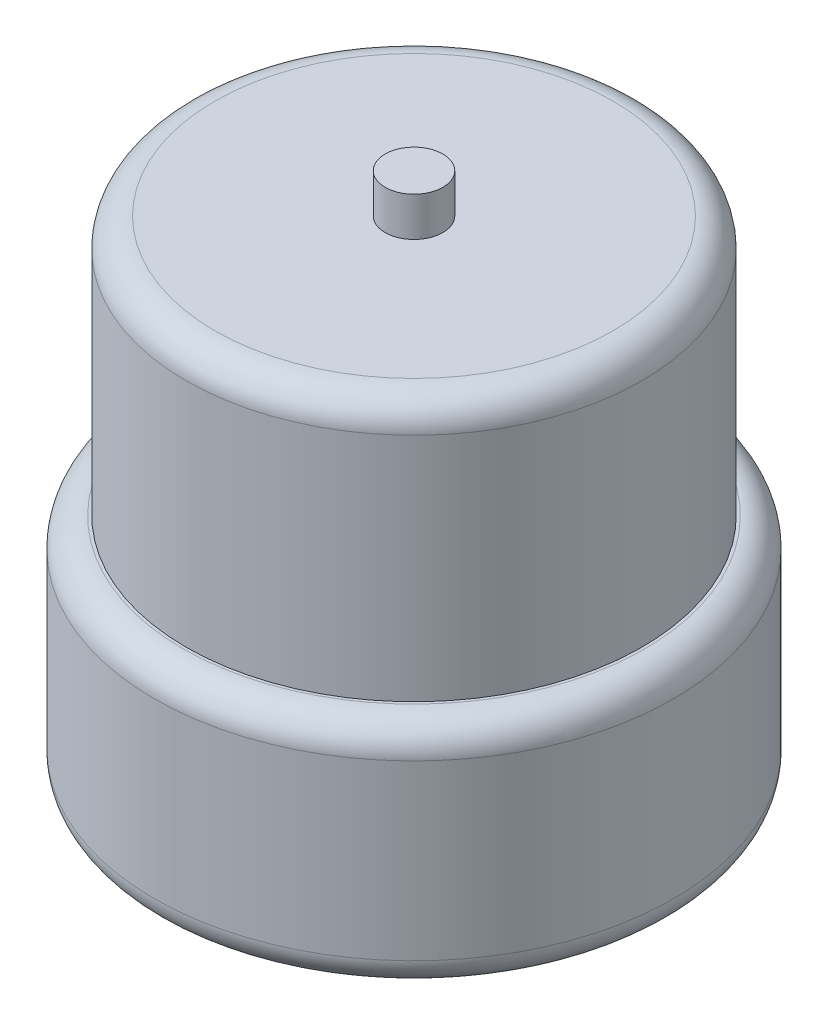
ISO-10303-21;
HEADER;
FILE_DESCRIPTION(('STEP AP214'),'2;1');
FILE_NAME('part.step','',(''),(''),'','','');
FILE_SCHEMA(('AUTOMOTIVE_DESIGN { 1 0 10303 214 1 1 1 1 }'));
ENDSEC;
DATA;
#1=APPLICATION_CONTEXT('core data for automotive mechanical design processes');
#2=APPLICATION_PROTOCOL_DEFINITION('international standard','automotive_design',2000,#1);
#3=PRODUCT_CONTEXT('',#1,'mechanical');
#4=PRODUCT('Part','Part','',(#3));
#5=PRODUCT_RELATED_PRODUCT_CATEGORY('part','',(#4));
#6=PRODUCT_DEFINITION_FORMATION('','',#4);
#7=PRODUCT_DEFINITION_CONTEXT('part definition',#1,'design');
#8=PRODUCT_DEFINITION('design','',#6,#7);
#9=PRODUCT_DEFINITION_SHAPE('','',#8);
#10=(LENGTH_UNIT() NAMED_UNIT(*) SI_UNIT(.MILLI.,.METRE.));
#11=(NAMED_UNIT(*) PLANE_ANGLE_UNIT() SI_UNIT($,.RADIAN.));
#12=(NAMED_UNIT(*) SI_UNIT($,.STERADIAN.) SOLID_ANGLE_UNIT());
#13=UNCERTAINTY_MEASURE_WITH_UNIT(LENGTH_MEASURE(1.E-05),#10,'distance_accuracy_value','');
#14=(GEOMETRIC_REPRESENTATION_CONTEXT(3) GLOBAL_UNCERTAINTY_ASSIGNED_CONTEXT((#13)) GLOBAL_UNIT_ASSIGNED_CONTEXT((#10,
#11,#12)) REPRESENTATION_CONTEXT('',''));
#15=CARTESIAN_POINT('',(0.,0.,0.));
#16=DIRECTION('',(0.,0.,1.));
#17=DIRECTION('',(1.,0.,0.));
#18=AXIS2_PLACEMENT_3D('',#15,#16,#17);
#19=CARTESIAN_POINT('',(0.,40.,0.));
#20=DIRECTION('',(0.,-1.,0.));
#21=DIRECTION('',(0.,0.,-1.));
#22=AXIS2_PLACEMENT_3D('',#19,#20,#21);
#23=CYLINDRICAL_SURFACE('',#22,45.);
#24=CARTESIAN_POINT('',(0.,5.,0.));
#25=DIRECTION('',(0.,1.,0.));
#26=DIRECTION('',(0.,0.,1.));
#27=AXIS2_PLACEMENT_3D('',#24,#25,#26);
#28=CIRCLE('',#27,45.);
#29=CARTESIAN_POINT('',(0.,5.,45.));
#30=VERTEX_POINT('',#29);
#31=EDGE_CURVE('E60',#30,#30,#28,.T.);
#32=ORIENTED_EDGE('',*,*,#31,.T.);
#33=EDGE_LOOP('',(#32));
#34=FACE_BOUND('',#33,.T.);
#35=CARTESIAN_POINT('',(0.,35.,0.));
#36=DIRECTION('',(0.,1.,0.));
#37=DIRECTION('',(0.,0.,1.));
#38=AXIS2_PLACEMENT_3D('',#35,#36,#37);
#39=CIRCLE('',#38,45.);
#40=CARTESIAN_POINT('',(0.,35.,45.));
#41=VERTEX_POINT('',#40);
#42=EDGE_CURVE('E64',#41,#41,#39,.F.);
#43=ORIENTED_EDGE('',*,*,#42,.T.);
#44=EDGE_LOOP('',(#43));
#45=FACE_BOUND('',#44,.T.);
#46=ADVANCED_FACE('F36',(#34,#45),#23,.T.);
#47=CARTESIAN_POINT('',(0.,40.,0.));
#48=DIRECTION('',(0.,1.,0.));
#49=DIRECTION('',(0.,0.,1.));
#50=AXIS2_PLACEMENT_3D('',#47,#48,#49);
#51=PLANE('',#50);
#52=CARTESIAN_POINT('',(0.,40.,0.));
#53=DIRECTION('',(0.,1.,0.));
#54=DIRECTION('',(0.,0.,1.));
#55=AXIS2_PLACEMENT_3D('',#52,#53,#54);
#56=CIRCLE('',#55,40.);
#57=CARTESIAN_POINT('',(0.,40.,40.));
#58=VERTEX_POINT('',#57);
#59=EDGE_CURVE('E49',#58,#58,#56,.T.);
#60=ORIENTED_EDGE('',*,*,#59,.T.);
#61=EDGE_LOOP('',(#60));
#62=FACE_BOUND('',#61,.T.);
#63=CARTESIAN_POINT('',(0.,40.,0.));
#64=DIRECTION('',(0.,1.,0.));
#65=DIRECTION('',(0.,0.,1.));
#66=AXIS2_PLACEMENT_3D('',#63,#64,#65);
#67=CIRCLE('',#66,39.5);
#68=CARTESIAN_POINT('',(0.,40.,39.5));
#69=VERTEX_POINT('',#68);
#70=EDGE_CURVE('E68',#69,#69,#67,.T.);
#71=ORIENTED_EDGE('',*,*,#70,.F.);
#72=EDGE_LOOP('',(#71));
#73=FACE_BOUND('',#72,.T.);
#74=ADVANCED_FACE('F100',(#62,#73),#51,.T.);
#75=CARTESIAN_POINT('',(0.,0.,0.));
#76=DIRECTION('',(0.,1.,0.));
#77=DIRECTION('',(0.,0.,1.));
#78=AXIS2_PLACEMENT_3D('',#75,#76,#77);
#79=PLANE('',#78);
#80=CARTESIAN_POINT('',(0.,0.,0.));
#81=DIRECTION('',(0.,1.,0.));
#82=DIRECTION('',(0.,0.,1.));
#83=AXIS2_PLACEMENT_3D('',#80,#81,#82);
#84=CIRCLE('',#83,40.);
#85=CARTESIAN_POINT('',(0.,0.,40.));
#86=VERTEX_POINT('',#85);
#87=EDGE_CURVE('E54',#86,#86,#84,.F.);
#88=ORIENTED_EDGE('',*,*,#87,.T.);
#89=EDGE_LOOP('',(#88));
#90=FACE_BOUND('',#89,.T.);
#91=ADVANCED_FACE('F97',(#90),#79,.F.);
#92=CARTESIAN_POINT('',(0.,85.,0.));
#93=DIRECTION('',(0.,-1.,0.));
#94=DIRECTION('',(0.,0.,-1.));
#95=AXIS2_PLACEMENT_3D('',#92,#93,#94);
#96=CYLINDRICAL_SURFACE('',#95,39.5);
#97=CARTESIAN_POINT('',(0.,80.,0.));
#98=DIRECTION('',(0.,1.,0.));
#99=DIRECTION('',(0.,0.,1.));
#100=AXIS2_PLACEMENT_3D('',#97,#98,#99);
#101=CIRCLE('',#100,39.5);
#102=CARTESIAN_POINT('',(0.,80.,39.5));
#103=VERTEX_POINT('',#102);
#104=EDGE_CURVE('E10',#103,#103,#101,.F.);
#105=ORIENTED_EDGE('',*,*,#104,.T.);
#106=EDGE_LOOP('',(#105));
#107=FACE_BOUND('',#106,.T.);
#108=ORIENTED_EDGE('',*,*,#70,.T.);
#109=EDGE_LOOP('',(#108));
#110=FACE_BOUND('',#109,.T.);
#111=ADVANCED_FACE('F91',(#107,#110),#96,.T.);
#112=CARTESIAN_POINT('',(0.,85.,0.));
#113=DIRECTION('',(0.,1.,0.));
#114=DIRECTION('',(0.,0.,1.));
#115=AXIS2_PLACEMENT_3D('',#112,#113,#114);
#116=PLANE('',#115);
#117=CARTESIAN_POINT('',(0.,85.,0.));
#118=DIRECTION('',(0.,1.,0.));
#119=DIRECTION('',(0.,0.,1.));
#120=AXIS2_PLACEMENT_3D('',#117,#118,#119);
#121=CIRCLE('',#120,34.5);
#122=CARTESIAN_POINT('',(0.,85.,34.5));
#123=VERTEX_POINT('',#122);
#124=EDGE_CURVE('E44',#123,#123,#121,.T.);
#125=ORIENTED_EDGE('',*,*,#124,.T.);
#126=EDGE_LOOP('',(#125));
#127=FACE_BOUND('',#126,.T.);
#128=CARTESIAN_POINT('',(0.,85.,0.));
#129=DIRECTION('',(0.,1.,0.));
#130=DIRECTION('',(0.,0.,1.));
#131=AXIS2_PLACEMENT_3D('',#128,#129,#130);
#132=CIRCLE('',#131,5.);
#133=CARTESIAN_POINT('',(0.,85.,5.));
#134=VERTEX_POINT('',#133);
#135=EDGE_CURVE('E73',#134,#134,#132,.T.);
#136=ORIENTED_EDGE('',*,*,#135,.F.);
#137=EDGE_LOOP('',(#136));
#138=FACE_BOUND('',#137,.T.);
#139=ADVANCED_FACE('F86',(#127,#138),#116,.T.);
#140=CARTESIAN_POINT('',(0.,91.8,0.));
#141=DIRECTION('',(0.,-1.,0.));
#142=DIRECTION('',(0.,0.,-1.));
#143=AXIS2_PLACEMENT_3D('',#140,#141,#142);
#144=CYLINDRICAL_SURFACE('',#143,5.);
#145=CARTESIAN_POINT('',(0.,91.8,0.));
#146=DIRECTION('',(0.,1.,0.));
#147=DIRECTION('',(0.,0.,1.));
#148=AXIS2_PLACEMENT_3D('',#145,#146,#147);
#149=CIRCLE('',#148,5.);
#150=CARTESIAN_POINT('',(0.,91.8,5.));
#151=VERTEX_POINT('',#150);
#152=EDGE_CURVE('E72',#151,#151,#149,.T.);
#153=ORIENTED_EDGE('',*,*,#152,.F.);
#154=EDGE_LOOP('',(#153));
#155=FACE_BOUND('',#154,.T.);
#156=ORIENTED_EDGE('',*,*,#135,.T.);
#157=EDGE_LOOP('',(#156));
#158=FACE_BOUND('',#157,.T.);
#159=ADVANCED_FACE('F83',(#155,#158),#144,.T.);
#160=CARTESIAN_POINT('',(0.,91.8,0.));
#161=DIRECTION('',(0.,1.,0.));
#162=DIRECTION('',(0.,0.,1.));
#163=AXIS2_PLACEMENT_3D('',#160,#161,#162);
#164=PLANE('',#163);
#165=ORIENTED_EDGE('',*,*,#152,.T.);
#166=EDGE_LOOP('',(#165));
#167=FACE_BOUND('',#166,.T.);
#168=ADVANCED_FACE('F81',(#167),#164,.T.);
#169=CARTESIAN_POINT('',(0.,5.,0.));
#170=DIRECTION('',(0.,1.,0.));
#171=DIRECTION('',(0.,0.,1.));
#172=AXIS2_PLACEMENT_3D('',#169,#170,#171);
#173=TOROIDAL_SURFACE('',#172,40.,5.);
#174=ORIENTED_EDGE('',*,*,#87,.F.);
#175=EDGE_LOOP('',(#174));
#176=FACE_BOUND('',#175,.T.);
#177=ORIENTED_EDGE('',*,*,#31,.F.);
#178=EDGE_LOOP('',(#177));
#179=FACE_BOUND('',#178,.T.);
#180=ADVANCED_FACE('F112',(#176,#179),#173,.T.);
#181=CARTESIAN_POINT('',(0.,35.,0.));
#182=DIRECTION('',(0.,1.,0.));
#183=DIRECTION('',(0.,0.,1.));
#184=AXIS2_PLACEMENT_3D('',#181,#182,#183);
#185=TOROIDAL_SURFACE('',#184,40.,5.);
#186=ORIENTED_EDGE('',*,*,#42,.F.);
#187=EDGE_LOOP('',(#186));
#188=FACE_BOUND('',#187,.T.);
#189=ORIENTED_EDGE('',*,*,#59,.F.);
#190=EDGE_LOOP('',(#189));
#191=FACE_BOUND('',#190,.T.);
#192=ADVANCED_FACE('F114',(#188,#191),#185,.T.);
#193=CARTESIAN_POINT('',(0.,80.,0.));
#194=DIRECTION('',(0.,1.,0.));
#195=DIRECTION('',(0.,0.,1.));
#196=AXIS2_PLACEMENT_3D('',#193,#194,#195);
#197=TOROIDAL_SURFACE('',#196,34.5,5.);
#198=ORIENTED_EDGE('',*,*,#104,.F.);
#199=EDGE_LOOP('',(#198));
#200=FACE_BOUND('',#199,.T.);
#201=ORIENTED_EDGE('',*,*,#124,.F.);
#202=EDGE_LOOP('',(#201));
#203=FACE_BOUND('',#202,.T.);
#204=ADVANCED_FACE('F38',(#200,#203),#197,.T.);
#205=CLOSED_SHELL('',(#46,#74,#91,#111,#139,#159,#168,#180,#192,#204));
#206=MANIFOLD_SOLID_BREP('B2',#205);
#207=ADVANCED_BREP_SHAPE_REPRESENTATION('',(#18,#206),#14);
#208=SHAPE_DEFINITION_REPRESENTATION(#9,#207);
ENDSEC;
END-ISO-10303-21;
